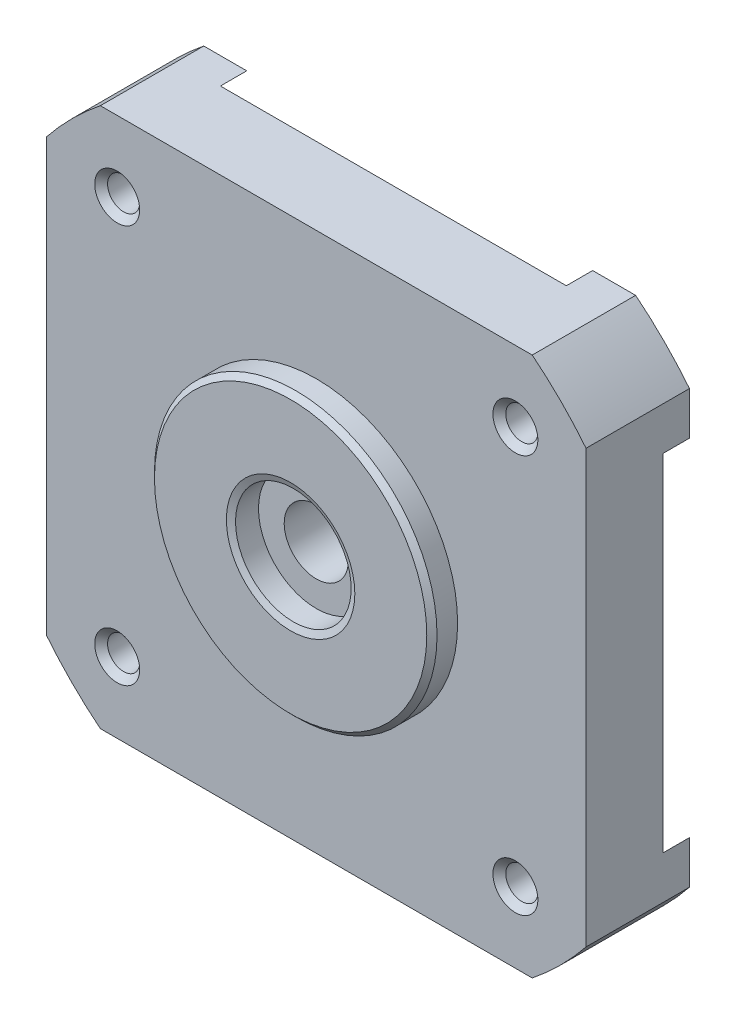
ISO-10303-21;
HEADER;
FILE_DESCRIPTION(('STEP AP214'),'2;1');
FILE_NAME('part.step','',(''),(''),'','','');
FILE_SCHEMA(('AUTOMOTIVE_DESIGN { 1 0 10303 214 1 1 1 1 }'));
ENDSEC;
DATA;
#1=APPLICATION_CONTEXT('core data for automotive mechanical design processes');
#2=APPLICATION_PROTOCOL_DEFINITION('international standard','automotive_design',2000,#1);
#3=PRODUCT_CONTEXT('',#1,'mechanical');
#4=PRODUCT('Part','Part','',(#3));
#5=PRODUCT_RELATED_PRODUCT_CATEGORY('part','',(#4));
#6=PRODUCT_DEFINITION_FORMATION('','',#4);
#7=PRODUCT_DEFINITION_CONTEXT('part definition',#1,'design');
#8=PRODUCT_DEFINITION('design','',#6,#7);
#9=PRODUCT_DEFINITION_SHAPE('','',#8);
#10=(LENGTH_UNIT() NAMED_UNIT(*) SI_UNIT(.MILLI.,.METRE.));
#11=(NAMED_UNIT(*) PLANE_ANGLE_UNIT() SI_UNIT($,.RADIAN.));
#12=(NAMED_UNIT(*) SI_UNIT($,.STERADIAN.) SOLID_ANGLE_UNIT());
#13=UNCERTAINTY_MEASURE_WITH_UNIT(LENGTH_MEASURE(1.E-05),#10,'distance_accuracy_value','');
#14=(GEOMETRIC_REPRESENTATION_CONTEXT(3) GLOBAL_UNCERTAINTY_ASSIGNED_CONTEXT((#13)) GLOBAL_UNIT_ASSIGNED_CONTEXT((#10,
#11,#12)) REPRESENTATION_CONTEXT('',''));
#15=CARTESIAN_POINT('',(0.,0.,0.));
#16=DIRECTION('',(0.,0.,1.));
#17=DIRECTION('',(1.,0.,0.));
#18=AXIS2_PLACEMENT_3D('',#15,#16,#17);
#19=CARTESIAN_POINT('',(-12.7931585590212,-13.4012649496147,22.25));
#20=DIRECTION('',(0.,0.,1.));
#21=DIRECTION('',(1.,0.,0.));
#22=AXIS2_PLACEMENT_3D('',#19,#20,#21);
#23=PLANE('',#22);
#24=CARTESIAN_POINT('',(0.,0.,22.250000000001));
#25=DIRECTION('',(0.,0.,1.));
#26=DIRECTION('',(1.,0.,0.));
#27=AXIS2_PLACEMENT_3D('',#24,#25,#26);
#28=CIRCLE('',#27,4.99999999999545);
#29=CARTESIAN_POINT('',(4.99999999999545,0.,22.250000000001));
#30=VERTEX_POINT('',#29);
#31=EDGE_CURVE('E217',#30,#30,#28,.F.);
#32=ORIENTED_EDGE('',*,*,#31,.T.);
#33=EDGE_LOOP('',(#32));
#34=FACE_BOUND('',#33,.T.);
#35=CARTESIAN_POINT('',(0.,0.,22.25));
#36=DIRECTION('',(0.,0.,-1.));
#37=DIRECTION('',(-1.,0.,0.));
#38=AXIS2_PLACEMENT_3D('',#35,#36,#37);
#39=CIRCLE('',#38,10.6000000000001);
#40=CARTESIAN_POINT('',(-10.6000000000001,0.,22.25));
#41=VERTEX_POINT('',#40);
#42=EDGE_CURVE('E20',#41,#41,#39,.T.);
#43=ORIENTED_EDGE('',*,*,#42,.F.);
#44=EDGE_LOOP('',(#43));
#45=FACE_BOUND('',#44,.T.);
#46=ADVANCED_FACE('F17',(#34,#45),#23,.T.);
#47=CARTESIAN_POINT('',(0.,0.,21.85));
#48=DIRECTION('',(0.,0.,-1.));
#49=DIRECTION('',(-1.,0.,0.));
#50=AXIS2_PLACEMENT_3D('',#47,#48,#49);
#51=CONICAL_SURFACE('',#50,11.0000000000001,0.785398163397461);
#52=CARTESIAN_POINT('',(0.,0.,21.85));
#53=DIRECTION('',(0.,0.,1.));
#54=DIRECTION('',(1.,0.,0.));
#55=AXIS2_PLACEMENT_3D('',#52,#53,#54);
#56=CIRCLE('',#55,11.0000000000001);
#57=CARTESIAN_POINT('',(11.0000000000001,0.,21.85));
#58=VERTEX_POINT('',#57);
#59=EDGE_CURVE('E213',#58,#58,#56,.F.);
#60=ORIENTED_EDGE('',*,*,#59,.F.);
#61=EDGE_LOOP('',(#60));
#62=FACE_BOUND('',#61,.T.);
#63=ORIENTED_EDGE('',*,*,#42,.T.);
#64=EDGE_LOOP('',(#63));
#65=FACE_BOUND('',#64,.T.);
#66=ADVANCED_FACE('F271',(#62,#65),#51,.T.);
#67=CARTESIAN_POINT('',(0.,0.,22.2499999999286));
#68=DIRECTION('',(0.,0.,1.));
#69=DIRECTION('',(1.,0.,0.));
#70=AXIS2_PLACEMENT_3D('',#67,#68,#69);
#71=CONICAL_SURFACE('',#70,4.99999999982492,1.16937059886515);
#72=ORIENTED_EDGE('',*,*,#31,.F.);
#73=EDGE_LOOP('',(#72));
#74=FACE_BOUND('',#73,.T.);
#75=CARTESIAN_POINT('',(0.,0.,22.0377625918952));
#76=DIRECTION('',(0.,0.,-1.));
#77=DIRECTION('',(-1.,0.,0.));
#78=AXIS2_PLACEMENT_3D('',#75,#76,#77);
#79=CIRCLE('',#78,4.5);
#80=CARTESIAN_POINT('',(-4.5,0.,22.0377625918952));
#81=VERTEX_POINT('',#80);
#82=EDGE_CURVE('E141',#81,#81,#79,.T.);
#83=ORIENTED_EDGE('',*,*,#82,.T.);
#84=EDGE_LOOP('',(#83));
#85=FACE_BOUND('',#84,.T.);
#86=ADVANCED_FACE('F278',(#74,#85),#71,.F.);
#87=CARTESIAN_POINT('',(0.,0.,20.75));
#88=DIRECTION('',(0.,0.,1.));
#89=DIRECTION('',(1.,0.,0.));
#90=AXIS2_PLACEMENT_3D('',#87,#88,#89);
#91=CYLINDRICAL_SURFACE('',#90,11.0000000000001);
#92=CARTESIAN_POINT('',(0.,0.,20.25));
#93=DIRECTION('',(0.,0.,1.));
#94=DIRECTION('',(1.,0.,0.));
#95=AXIS2_PLACEMENT_3D('',#92,#93,#94);
#96=CIRCLE('',#95,11.0000000000001);
#97=CARTESIAN_POINT('',(11.0000000000001,0.,20.25));
#98=VERTEX_POINT('',#97);
#99=EDGE_CURVE('E254',#98,#98,#96,.F.);
#100=ORIENTED_EDGE('',*,*,#99,.F.);
#101=EDGE_LOOP('',(#100));
#102=FACE_BOUND('',#101,.T.);
#103=ORIENTED_EDGE('',*,*,#59,.T.);
#104=EDGE_LOOP('',(#103));
#105=FACE_BOUND('',#104,.T.);
#106=ADVANCED_FACE('F392',(#102,#105),#91,.T.);
#107=CARTESIAN_POINT('',(0.,0.,22.0377625918952));
#108=DIRECTION('',(0.,0.,-1.));
#109=DIRECTION('',(-1.,0.,0.));
#110=AXIS2_PLACEMENT_3D('',#107,#108,#109);
#111=CYLINDRICAL_SURFACE('',#110,4.5);
#112=CARTESIAN_POINT('',(0.,0.,20.25));
#113=DIRECTION('',(0.,0.,-1.));
#114=DIRECTION('',(-1.,0.,0.));
#115=AXIS2_PLACEMENT_3D('',#112,#113,#114);
#116=CIRCLE('',#115,4.5);
#117=CARTESIAN_POINT('',(-4.5,0.,20.25));
#118=VERTEX_POINT('',#117);
#119=EDGE_CURVE('E247',#118,#118,#116,.F.);
#120=ORIENTED_EDGE('',*,*,#119,.F.);
#121=EDGE_LOOP('',(#120));
#122=FACE_BOUND('',#121,.T.);
#123=ORIENTED_EDGE('',*,*,#82,.F.);
#124=EDGE_LOOP('',(#123));
#125=FACE_BOUND('',#124,.T.);
#126=ADVANCED_FACE('F389',(#122,#125),#111,.F.);
#127=CARTESIAN_POINT('',(-13.4544660940676,-21.01,12.2));
#128=DIRECTION('',(0.,0.,-1.));
#129=DIRECTION('',(-1.,0.,0.));
#130=AXIS2_PLACEMENT_3D('',#127,#128,#129);
#131=PLANE('',#130);
#132=CARTESIAN_POINT('',(-2.47024622979097E-12,-2.47024622979097E-12,12.2000000000001));
#133=DIRECTION('',(0.,0.,1.));
#134=DIRECTION('',(1.,0.,0.));
#135=AXIS2_PLACEMENT_3D('',#132,#133,#134);
#136=CIRCLE('',#135,26.8999999999965);
#137=CARTESIAN_POINT('',(-21.,-16.8110082981361,12.2));
#138=VERTEX_POINT('',#137);
#139=CARTESIAN_POINT('',(-16.8110082981361,-21.,12.2));
#140=VERTEX_POINT('',#139);
#141=EDGE_CURVE('E129',#138,#140,#136,.T.);
#142=ORIENTED_EDGE('',*,*,#141,.F.);
#143=DIRECTION('',(0.,1.,0.));
#144=VECTOR('',#143,1.);
#145=CARTESIAN_POINT('',(-21.,-16.8210082981361,12.2));
#146=LINE('',#145,#144);
#147=CARTESIAN_POINT('',(-21.,-13.4644660940669,12.2));
#148=VERTEX_POINT('',#147);
#149=EDGE_CURVE('E134',#148,#138,#146,.F.);
#150=ORIENTED_EDGE('',*,*,#149,.F.);
#151=DIRECTION('',(-0.707106781186515,0.70710678118658,0.));
#152=VECTOR('',#151,1.);
#153=CARTESIAN_POINT('',(-13.4573950262557,-21.0070710678119,12.2));
#154=LINE('',#153,#152);
#155=CARTESIAN_POINT('',(-13.4644660940676,-21.,12.2));
#156=VERTEX_POINT('',#155);
#157=EDGE_CURVE('E156',#156,#148,#154,.T.);
#158=ORIENTED_EDGE('',*,*,#157,.F.);
#159=DIRECTION('',(1.,0.,0.));
#160=VECTOR('',#159,1.);
#161=CARTESIAN_POINT('',(-16.8210082981361,-21.,12.2));
#162=LINE('',#161,#160);
#163=EDGE_CURVE('E136',#140,#156,#162,.T.);
#164=ORIENTED_EDGE('',*,*,#163,.F.);
#165=EDGE_LOOP('',(#142,#150,#158,#164));
#166=FACE_BOUND('',#165,.T.);
#167=ADVANCED_FACE('F131',(#166),#131,.T.);
#168=CARTESIAN_POINT('',(-2.47024622979097E-12,-2.47024622979097E-12,12.2000000000001));
#169=DIRECTION('',(0.,0.,1.));
#170=DIRECTION('',(1.,0.,0.));
#171=AXIS2_PLACEMENT_3D('',#168,#169,#170);
#172=CYLINDRICAL_SURFACE('',#171,26.8999999999965);
#173=CARTESIAN_POINT('',(-2.50033645199544E-12,-2.50033645199544E-12,20.2500000000001));
#174=DIRECTION('',(0.,0.,1.));
#175=DIRECTION('',(1.,0.,0.));
#176=AXIS2_PLACEMENT_3D('',#173,#174,#175);
#177=CIRCLE('',#176,26.8999999999965);
#178=CARTESIAN_POINT('',(-21.,-16.8110082981361,20.25));
#179=VERTEX_POINT('',#178);
#180=CARTESIAN_POINT('',(-16.8110082981361,-21.,20.25));
#181=VERTEX_POINT('',#180);
#182=EDGE_CURVE('E146',#179,#181,#177,.T.);
#183=ORIENTED_EDGE('',*,*,#182,.F.);
#184=DIRECTION('',(0.,0.,1.));
#185=VECTOR('',#184,1.);
#186=CARTESIAN_POINT('',(-21.,-16.8110082981361,12.19));
#187=LINE('',#186,#185);
#188=EDGE_CURVE('E144',#138,#179,#187,.T.);
#189=ORIENTED_EDGE('',*,*,#188,.F.);
#190=ORIENTED_EDGE('',*,*,#141,.T.);
#191=DIRECTION('',(0.,0.,-1.));
#192=VECTOR('',#191,1.);
#193=CARTESIAN_POINT('',(-16.8110082981361,-21.,20.26));
#194=LINE('',#193,#192);
#195=EDGE_CURVE('E180',#181,#140,#194,.T.);
#196=ORIENTED_EDGE('',*,*,#195,.F.);
#197=EDGE_LOOP('',(#183,#189,#190,#196));
#198=FACE_BOUND('',#197,.T.);
#199=ADVANCED_FACE('F145',(#198),#172,.T.);
#200=CARTESIAN_POINT('',(-2.47024622979097E-12,2.47024622979097E-12,12.2000000000001));
#201=DIRECTION('',(0.,0.,1.));
#202=DIRECTION('',(1.,0.,0.));
#203=AXIS2_PLACEMENT_3D('',#200,#201,#202);
#204=CYLINDRICAL_SURFACE('',#203,26.8999999999965);
#205=CARTESIAN_POINT('',(-2.50033645199544E-12,2.50033645199544E-12,20.2500000000001));
#206=DIRECTION('',(0.,0.,1.));
#207=DIRECTION('',(1.,0.,0.));
#208=AXIS2_PLACEMENT_3D('',#205,#206,#207);
#209=CIRCLE('',#208,26.8999999999965);
#210=CARTESIAN_POINT('',(-16.8110082981361,21.,20.25));
#211=VERTEX_POINT('',#210);
#212=CARTESIAN_POINT('',(-21.,16.8110082981361,20.25));
#213=VERTEX_POINT('',#212);
#214=EDGE_CURVE('E258',#211,#213,#209,.T.);
#215=ORIENTED_EDGE('',*,*,#214,.F.);
#216=DIRECTION('',(0.,0.,1.));
#217=VECTOR('',#216,1.);
#218=CARTESIAN_POINT('',(-16.8110082981361,21.,12.19));
#219=LINE('',#218,#217);
#220=CARTESIAN_POINT('',(-16.8110082981361,21.,12.2));
#221=VERTEX_POINT('',#220);
#222=EDGE_CURVE('E663',#221,#211,#219,.T.);
#223=ORIENTED_EDGE('',*,*,#222,.F.);
#224=CARTESIAN_POINT('',(-2.47024622979097E-12,2.47024622979097E-12,12.2000000000001));
#225=DIRECTION('',(0.,0.,1.));
#226=DIRECTION('',(1.,0.,0.));
#227=AXIS2_PLACEMENT_3D('',#224,#225,#226);
#228=CIRCLE('',#227,26.8999999999965);
#229=CARTESIAN_POINT('',(-21.,16.8110082981361,12.2));
#230=VERTEX_POINT('',#229);
#231=EDGE_CURVE('E140',#230,#221,#228,.F.);
#232=ORIENTED_EDGE('',*,*,#231,.F.);
#233=DIRECTION('',(0.,0.,1.));
#234=VECTOR('',#233,1.);
#235=CARTESIAN_POINT('',(-21.,16.8110082981361,12.19));
#236=LINE('',#235,#234);
#237=EDGE_CURVE('E694',#213,#230,#236,.F.);
#238=ORIENTED_EDGE('',*,*,#237,.F.);
#239=EDGE_LOOP('',(#215,#223,#232,#238));
#240=FACE_BOUND('',#239,.T.);
#241=ADVANCED_FACE('F380',(#240),#204,.T.);
#242=CARTESIAN_POINT('',(-13.4544660940671,13.4544660940671,12.2));
#243=DIRECTION('',(0.,0.,-1.));
#244=DIRECTION('',(-1.,0.,0.));
#245=AXIS2_PLACEMENT_3D('',#242,#243,#244);
#246=PLANE('',#245);
#247=ORIENTED_EDGE('',*,*,#231,.T.);
#248=DIRECTION('',(1.,0.,0.));
#249=VECTOR('',#248,1.);
#250=CARTESIAN_POINT('',(-16.8210082981361,21.,12.2));
#251=LINE('',#250,#249);
#252=CARTESIAN_POINT('',(-13.4644660940672,21.,12.2));
#253=VERTEX_POINT('',#252);
#254=EDGE_CURVE('E643',#253,#221,#251,.F.);
#255=ORIENTED_EDGE('',*,*,#254,.F.);
#256=DIRECTION('',(0.707106781186543,0.707106781186552,0.));
#257=VECTOR('',#256,1.);
#258=CARTESIAN_POINT('',(-21.0070710678119,13.4573950262552,12.2));
#259=LINE('',#258,#257);
#260=CARTESIAN_POINT('',(-21.,13.4644660940671,12.2));
#261=VERTEX_POINT('',#260);
#262=EDGE_CURVE('E667',#261,#253,#259,.T.);
#263=ORIENTED_EDGE('',*,*,#262,.F.);
#264=DIRECTION('',(0.,1.,0.));
#265=VECTOR('',#264,1.);
#266=CARTESIAN_POINT('',(-21.,-16.8210082981361,12.2));
#267=LINE('',#266,#265);
#268=EDGE_CURVE('E690',#230,#261,#267,.F.);
#269=ORIENTED_EDGE('',*,*,#268,.F.);
#270=EDGE_LOOP('',(#247,#255,#263,#269));
#271=FACE_BOUND('',#270,.T.);
#272=ADVANCED_FACE('F376',(#271),#246,.T.);
#273=CARTESIAN_POINT('',(21.01,13.4544660940671,12.2));
#274=DIRECTION('',(0.,0.,-1.));
#275=DIRECTION('',(-1.,0.,0.));
#276=AXIS2_PLACEMENT_3D('',#273,#274,#275);
#277=PLANE('',#276);
#278=CARTESIAN_POINT('',(2.47024622979097E-12,2.47024622979097E-12,12.2000000000001));
#279=DIRECTION('',(0.,0.,1.));
#280=DIRECTION('',(1.,0.,0.));
#281=AXIS2_PLACEMENT_3D('',#278,#279,#280);
#282=CIRCLE('',#281,26.8999999999965);
#283=CARTESIAN_POINT('',(21.,16.8110082981361,12.2));
#284=VERTEX_POINT('',#283);
#285=CARTESIAN_POINT('',(16.8110082981361,21.,12.2));
#286=VERTEX_POINT('',#285);
#287=EDGE_CURVE('E262',#284,#286,#282,.T.);
#288=ORIENTED_EDGE('',*,*,#287,.F.);
#289=DIRECTION('',(0.,1.,0.));
#290=VECTOR('',#289,1.);
#291=CARTESIAN_POINT('',(21.,-16.8210082981361,12.2));
#292=LINE('',#291,#290);
#293=CARTESIAN_POINT('',(21.,13.4644660940671,12.2));
#294=VERTEX_POINT('',#293);
#295=EDGE_CURVE('E625',#294,#284,#292,.T.);
#296=ORIENTED_EDGE('',*,*,#295,.F.);
#297=DIRECTION('',(0.707106781186538,-0.707106781186557,0.));
#298=VECTOR('',#297,1.);
#299=CARTESIAN_POINT('',(21.0070710678119,13.4573950262553,12.2));
#300=LINE('',#299,#298);
#301=CARTESIAN_POINT('',(13.4644660940674,21.,12.2));
#302=VERTEX_POINT('',#301);
#303=EDGE_CURVE('E627',#302,#294,#300,.T.);
#304=ORIENTED_EDGE('',*,*,#303,.F.);
#305=DIRECTION('',(1.,0.,0.));
#306=VECTOR('',#305,1.);
#307=CARTESIAN_POINT('',(-16.8210082981361,21.,12.2));
#308=LINE('',#307,#306);
#309=EDGE_CURVE('E646',#286,#302,#308,.F.);
#310=ORIENTED_EDGE('',*,*,#309,.F.);
#311=EDGE_LOOP('',(#288,#296,#304,#310));
#312=FACE_BOUND('',#311,.T.);
#313=ADVANCED_FACE('F372',(#312),#277,.T.);
#314=CARTESIAN_POINT('',(2.47024622979097E-12,2.47024622979097E-12,12.2000000000001));
#315=DIRECTION('',(0.,0.,1.));
#316=DIRECTION('',(1.,0.,0.));
#317=AXIS2_PLACEMENT_3D('',#314,#315,#316);
#318=CYLINDRICAL_SURFACE('',#317,26.8999999999965);
#319=CARTESIAN_POINT('',(2.50033645199544E-12,2.50033645199544E-12,20.2500000000001));
#320=DIRECTION('',(0.,0.,1.));
#321=DIRECTION('',(1.,0.,0.));
#322=AXIS2_PLACEMENT_3D('',#319,#320,#321);
#323=CIRCLE('',#322,26.8999999999965);
#324=CARTESIAN_POINT('',(21.,16.8110082981361,20.25));
#325=VERTEX_POINT('',#324);
#326=CARTESIAN_POINT('',(16.8110082981361,21.,20.25));
#327=VERTEX_POINT('',#326);
#328=EDGE_CURVE('E260',#325,#327,#323,.T.);
#329=ORIENTED_EDGE('',*,*,#328,.F.);
#330=DIRECTION('',(0.,0.,-1.));
#331=VECTOR('',#330,1.);
#332=CARTESIAN_POINT('',(21.,16.8110082981361,20.26));
#333=LINE('',#332,#331);
#334=EDGE_CURVE('E621',#284,#325,#333,.F.);
#335=ORIENTED_EDGE('',*,*,#334,.F.);
#336=ORIENTED_EDGE('',*,*,#287,.T.);
#337=DIRECTION('',(0.,0.,1.));
#338=VECTOR('',#337,1.);
#339=CARTESIAN_POINT('',(16.8110082981361,21.,12.19));
#340=LINE('',#339,#338);
#341=EDGE_CURVE('E649',#327,#286,#340,.F.);
#342=ORIENTED_EDGE('',*,*,#341,.F.);
#343=EDGE_LOOP('',(#329,#335,#336,#342));
#344=FACE_BOUND('',#343,.T.);
#345=ADVANCED_FACE('F368',(#344),#318,.T.);
#346=CARTESIAN_POINT('',(-21.01,-21.01,20.25));
#347=DIRECTION('',(0.,0.,1.));
#348=DIRECTION('',(1.,0.,0.));
#349=AXIS2_PLACEMENT_3D('',#346,#347,#348);
#350=PLANE('',#349);
#351=CARTESIAN_POINT('',(15.5,15.5000000000009,20.2499999999445));
#352=DIRECTION('',(0.,0.,1.));
#353=DIRECTION('',(1.,0.,0.));
#354=AXIS2_PLACEMENT_3D('',#351,#352,#353);
#355=CIRCLE('',#354,1.74999999995862);
#356=CARTESIAN_POINT('',(17.2499999999586,15.5000000000009,20.2499999999445));
#357=VERTEX_POINT('',#356);
#358=EDGE_CURVE('E238',#357,#357,#355,.F.);
#359=ORIENTED_EDGE('',*,*,#358,.T.);
#360=EDGE_LOOP('',(#359));
#361=FACE_BOUND('',#360,.T.);
#362=CARTESIAN_POINT('',(-15.4999999999992,-15.5,20.2499999999512));
#363=DIRECTION('',(0.,0.,1.));
#364=DIRECTION('',(1.,0.,0.));
#365=AXIS2_PLACEMENT_3D('',#362,#363,#364);
#366=CIRCLE('',#365,1.75000000001546);
#367=CARTESIAN_POINT('',(-13.7499999999837,-15.5,20.2499999999512));
#368=VERTEX_POINT('',#367);
#369=EDGE_CURVE('E244',#368,#368,#366,.F.);
#370=ORIENTED_EDGE('',*,*,#369,.T.);
#371=EDGE_LOOP('',(#370));
#372=FACE_BOUND('',#371,.T.);
#373=CARTESIAN_POINT('',(-15.5,15.5,20.2499999999759));
#374=DIRECTION('',(0.,0.,1.));
#375=DIRECTION('',(1.,0.,0.));
#376=AXIS2_PLACEMENT_3D('',#373,#374,#375);
#377=CIRCLE('',#376,1.74999999998408);
#378=CARTESIAN_POINT('',(-13.7500000000159,15.5,20.2499999999759));
#379=VERTEX_POINT('',#378);
#380=EDGE_CURVE('E241',#379,#379,#377,.F.);
#381=ORIENTED_EDGE('',*,*,#380,.T.);
#382=EDGE_LOOP('',(#381));
#383=FACE_BOUND('',#382,.T.);
#384=CARTESIAN_POINT('',(15.5000000000009,-15.4999999999992,20.2499999999759));
#385=DIRECTION('',(0.,0.,1.));
#386=DIRECTION('',(1.,0.,0.));
#387=AXIS2_PLACEMENT_3D('',#384,#385,#386);
#388=CIRCLE('',#387,1.7499999999891);
#389=CARTESIAN_POINT('',(17.24999999999,-15.4999999999992,20.2499999999759));
#390=VERTEX_POINT('',#389);
#391=EDGE_CURVE('E235',#390,#390,#388,.F.);
#392=ORIENTED_EDGE('',*,*,#391,.T.);
#393=EDGE_LOOP('',(#392));
#394=FACE_BOUND('',#393,.T.);
#395=ORIENTED_EDGE('',*,*,#99,.T.);
#396=EDGE_LOOP('',(#395));
#397=FACE_BOUND('',#396,.T.);
#398=ORIENTED_EDGE('',*,*,#182,.T.);
#399=DIRECTION('',(1.,0.,0.));
#400=VECTOR('',#399,1.);
#401=CARTESIAN_POINT('',(-16.8210082981361,-21.,20.25));
#402=LINE('',#401,#400);
#403=CARTESIAN_POINT('',(16.8110082981361,-21.,20.25));
#404=VERTEX_POINT('',#403);
#405=EDGE_CURVE('E189',#404,#181,#402,.F.);
#406=ORIENTED_EDGE('',*,*,#405,.F.);
#407=CARTESIAN_POINT('',(2.50033645199544E-12,-2.50033645199544E-12,20.2500000000001));
#408=DIRECTION('',(0.,0.,1.));
#409=DIRECTION('',(1.,0.,0.));
#410=AXIS2_PLACEMENT_3D('',#407,#408,#409);
#411=CIRCLE('',#410,26.8999999999965);
#412=CARTESIAN_POINT('',(21.,-16.8110082981361,20.25));
#413=VERTEX_POINT('',#412);
#414=EDGE_CURVE('E252',#413,#404,#411,.F.);
#415=ORIENTED_EDGE('',*,*,#414,.F.);
#416=DIRECTION('',(0.,1.,0.));
#417=VECTOR('',#416,1.);
#418=CARTESIAN_POINT('',(21.,-16.8210082981361,20.25));
#419=LINE('',#418,#417);
#420=EDGE_CURVE('E617',#325,#413,#419,.F.);
#421=ORIENTED_EDGE('',*,*,#420,.F.);
#422=ORIENTED_EDGE('',*,*,#328,.T.);
#423=DIRECTION('',(1.,0.,0.));
#424=VECTOR('',#423,1.);
#425=CARTESIAN_POINT('',(-16.8210082981361,21.,20.25));
#426=LINE('',#425,#424);
#427=EDGE_CURVE('E666',#211,#327,#426,.T.);
#428=ORIENTED_EDGE('',*,*,#427,.F.);
#429=ORIENTED_EDGE('',*,*,#214,.T.);
#430=DIRECTION('',(0.,1.,0.));
#431=VECTOR('',#430,1.);
#432=CARTESIAN_POINT('',(-21.,-16.8210082981361,20.25));
#433=LINE('',#432,#431);
#434=EDGE_CURVE('E150',#179,#213,#433,.T.);
#435=ORIENTED_EDGE('',*,*,#434,.F.);
#436=EDGE_LOOP('',(#398,#406,#415,#421,#422,#428,#429,#435));
#437=FACE_BOUND('',#436,.T.);
#438=ADVANCED_FACE('F364',(#361,#372,#383,#394,#397,#437),#350,.T.);
#439=CARTESIAN_POINT('',(2.47024622979097E-12,-2.47024622979097E-12,12.2000000000001));
#440=DIRECTION('',(0.,0.,1.));
#441=DIRECTION('',(1.,0.,0.));
#442=AXIS2_PLACEMENT_3D('',#439,#440,#441);
#443=CYLINDRICAL_SURFACE('',#442,26.8999999999965);
#444=ORIENTED_EDGE('',*,*,#414,.T.);
#445=DIRECTION('',(0.,0.,-1.));
#446=VECTOR('',#445,1.);
#447=CARTESIAN_POINT('',(16.8110082981361,-21.,20.26));
#448=LINE('',#447,#446);
#449=CARTESIAN_POINT('',(16.8110082981361,-21.,12.2));
#450=VERTEX_POINT('',#449);
#451=EDGE_CURVE('E192',#450,#404,#448,.F.);
#452=ORIENTED_EDGE('',*,*,#451,.F.);
#453=CARTESIAN_POINT('',(2.47024622979097E-12,-2.47024622979097E-12,12.2000000000001));
#454=DIRECTION('',(0.,0.,1.));
#455=DIRECTION('',(1.,0.,0.));
#456=AXIS2_PLACEMENT_3D('',#453,#454,#455);
#457=CIRCLE('',#456,26.8999999999965);
#458=CARTESIAN_POINT('',(21.,-16.8110082981361,12.2));
#459=VERTEX_POINT('',#458);
#460=EDGE_CURVE('E250',#459,#450,#457,.F.);
#461=ORIENTED_EDGE('',*,*,#460,.F.);
#462=DIRECTION('',(0.,0.,-1.));
#463=VECTOR('',#462,1.);
#464=CARTESIAN_POINT('',(21.,-16.8110082981361,20.26));
#465=LINE('',#464,#463);
#466=EDGE_CURVE('E614',#413,#459,#465,.T.);
#467=ORIENTED_EDGE('',*,*,#466,.F.);
#468=EDGE_LOOP('',(#444,#452,#461,#467));
#469=FACE_BOUND('',#468,.T.);
#470=ADVANCED_FACE('F360',(#469),#443,.T.);
#471=CARTESIAN_POINT('',(21.01,-21.01,12.2));
#472=DIRECTION('',(0.,0.,-1.));
#473=DIRECTION('',(-1.,0.,0.));
#474=AXIS2_PLACEMENT_3D('',#471,#472,#473);
#475=PLANE('',#474);
#476=ORIENTED_EDGE('',*,*,#460,.T.);
#477=DIRECTION('',(1.,0.,0.));
#478=VECTOR('',#477,1.);
#479=CARTESIAN_POINT('',(-16.8210082981361,-21.,12.2));
#480=LINE('',#479,#478);
#481=CARTESIAN_POINT('',(13.4644660940674,-21.,12.2));
#482=VERTEX_POINT('',#481);
#483=EDGE_CURVE('E195',#482,#450,#480,.T.);
#484=ORIENTED_EDGE('',*,*,#483,.F.);
#485=DIRECTION('',(-0.707106781186543,-0.707106781186552,0.));
#486=VECTOR('',#485,1.);
#487=CARTESIAN_POINT('',(13.4573950262555,-21.0070710678119,12.2));
#488=LINE('',#487,#486);
#489=CARTESIAN_POINT('',(21.,-13.4644660940672,12.2));
#490=VERTEX_POINT('',#489);
#491=EDGE_CURVE('E203',#490,#482,#488,.T.);
#492=ORIENTED_EDGE('',*,*,#491,.F.);
#493=DIRECTION('',(0.,1.,0.));
#494=VECTOR('',#493,1.);
#495=CARTESIAN_POINT('',(21.,-16.8210082981361,12.2));
#496=LINE('',#495,#494);
#497=EDGE_CURVE('E714',#459,#490,#496,.T.);
#498=ORIENTED_EDGE('',*,*,#497,.F.);
#499=EDGE_LOOP('',(#476,#484,#492,#498));
#500=FACE_BOUND('',#499,.T.);
#501=ADVANCED_FACE('F356',(#500),#475,.T.);
#502=CARTESIAN_POINT('',(-4.51,-4.51,20.25));
#503=DIRECTION('',(0.,0.,1.));
#504=DIRECTION('',(1.,0.,0.));
#505=AXIS2_PLACEMENT_3D('',#502,#503,#504);
#506=PLANE('',#505);
#507=CARTESIAN_POINT('',(0.,0.,20.25));
#508=DIRECTION('',(0.,0.,-1.));
#509=DIRECTION('',(0.,1.,0.));
#510=AXIS2_PLACEMENT_3D('',#507,#508,#509);
#511=CIRCLE('',#510,2.5);
#512=CARTESIAN_POINT('',(0.,2.50000000000004,20.25));
#513=VERTEX_POINT('',#512);
#514=EDGE_CURVE('E231',#513,#513,#511,.T.);
#515=ORIENTED_EDGE('',*,*,#514,.T.);
#516=EDGE_LOOP('',(#515));
#517=FACE_BOUND('',#516,.T.);
#518=ORIENTED_EDGE('',*,*,#119,.T.);
#519=EDGE_LOOP('',(#518));
#520=FACE_BOUND('',#519,.T.);
#521=ADVANCED_FACE('F352',(#517,#520),#506,.T.);
#522=CARTESIAN_POINT('',(-15.4999999999992,-15.5,20.2500000000327));
#523=DIRECTION('',(0.,0.,1.));
#524=DIRECTION('',(1.,0.,0.));
#525=AXIS2_PLACEMENT_3D('',#522,#523,#524);
#526=CONICAL_SURFACE('',#525,1.75000000009697,0.785398163454292);
#527=ORIENTED_EDGE('',*,*,#369,.F.);
#528=EDGE_LOOP('',(#527));
#529=FACE_BOUND('',#528,.T.);
#530=CARTESIAN_POINT('',(-15.4999999999992,-15.5,19.75));
#531=DIRECTION('',(0.,0.,1.));
#532=DIRECTION('',(1.,0.,0.));
#533=AXIS2_PLACEMENT_3D('',#530,#531,#532);
#534=CIRCLE('',#533,1.24999999999995);
#535=CARTESIAN_POINT('',(-14.2499999999992,-15.5,19.75));
#536=VERTEX_POINT('',#535);
#537=EDGE_CURVE('E234',#536,#536,#534,.F.);
#538=ORIENTED_EDGE('',*,*,#537,.T.);
#539=EDGE_LOOP('',(#538));
#540=FACE_BOUND('',#539,.T.);
#541=ADVANCED_FACE('F348',(#529,#540),#526,.F.);
#542=CARTESIAN_POINT('',(-15.5,15.5,20.2499999999759));
#543=DIRECTION('',(0.,0.,1.));
#544=DIRECTION('',(1.,0.,0.));
#545=AXIS2_PLACEMENT_3D('',#542,#543,#544);
#546=CONICAL_SURFACE('',#545,1.74999999998408,0.785398163340605);
#547=ORIENTED_EDGE('',*,*,#380,.F.);
#548=EDGE_LOOP('',(#547));
#549=FACE_BOUND('',#548,.T.);
#550=CARTESIAN_POINT('',(-15.5,15.5,19.75));
#551=DIRECTION('',(0.,0.,1.));
#552=DIRECTION('',(1.,0.,0.));
#553=AXIS2_PLACEMENT_3D('',#550,#551,#552);
#554=CIRCLE('',#553,1.25);
#555=CARTESIAN_POINT('',(-14.25,15.5,19.75));
#556=VERTEX_POINT('',#555);
#557=EDGE_CURVE('E727',#556,#556,#554,.F.);
#558=ORIENTED_EDGE('',*,*,#557,.T.);
#559=EDGE_LOOP('',(#558));
#560=FACE_BOUND('',#559,.T.);
#561=ADVANCED_FACE('F344',(#549,#560),#546,.F.);
#562=CARTESIAN_POINT('',(15.5,15.5000000000009,20.2499999998622));
#563=DIRECTION('',(0.,0.,1.));
#564=DIRECTION('',(1.,0.,0.));
#565=AXIS2_PLACEMENT_3D('',#562,#563,#564);
#566=CONICAL_SURFACE('',#565,1.74999999987631,0.785398163397448);
#567=ORIENTED_EDGE('',*,*,#358,.F.);
#568=EDGE_LOOP('',(#567));
#569=FACE_BOUND('',#568,.T.);
#570=CARTESIAN_POINT('',(15.5,15.5000000000009,19.75));
#571=DIRECTION('',(0.,0.,1.));
#572=DIRECTION('',(1.,0.,0.));
#573=AXIS2_PLACEMENT_3D('',#570,#571,#572);
#574=CIRCLE('',#573,1.25);
#575=CARTESIAN_POINT('',(16.75,15.5000000000009,19.75));
#576=VERTEX_POINT('',#575);
#577=EDGE_CURVE('E730',#576,#576,#574,.F.);
#578=ORIENTED_EDGE('',*,*,#577,.T.);
#579=EDGE_LOOP('',(#578));
#580=FACE_BOUND('',#579,.T.);
#581=ADVANCED_FACE('F340',(#569,#580),#566,.F.);
#582=CARTESIAN_POINT('',(15.5000000000009,-15.4999999999992,20.2499999999759));
#583=DIRECTION('',(0.,0.,1.));
#584=DIRECTION('',(1.,0.,0.));
#585=AXIS2_PLACEMENT_3D('',#582,#583,#584);
#586=CONICAL_SURFACE('',#585,1.7499999999891,0.785398163340605);
#587=ORIENTED_EDGE('',*,*,#391,.F.);
#588=EDGE_LOOP('',(#587));
#589=FACE_BOUND('',#588,.T.);
#590=CARTESIAN_POINT('',(15.5000000000009,-15.4999999999992,19.75));
#591=DIRECTION('',(0.,0.,1.));
#592=DIRECTION('',(1.,0.,0.));
#593=AXIS2_PLACEMENT_3D('',#590,#591,#592);
#594=CIRCLE('',#593,1.24999999999995);
#595=CARTESIAN_POINT('',(16.7500000000009,-15.4999999999992,19.75));
#596=VERTEX_POINT('',#595);
#597=EDGE_CURVE('E208',#596,#596,#594,.F.);
#598=ORIENTED_EDGE('',*,*,#597,.T.);
#599=EDGE_LOOP('',(#598));
#600=FACE_BOUND('',#599,.T.);
#601=ADVANCED_FACE('F336',(#589,#600),#586,.F.);
#602=CARTESIAN_POINT('',(13.4573950262555,-21.0070710678119,12.19));
#603=DIRECTION('',(-0.707106781186552,0.707106781186543,0.));
#604=DIRECTION('',(-0.707106781186543,-0.707106781186552,0.));
#605=AXIS2_PLACEMENT_3D('',#602,#603,#604);
#606=PLANE('',#605);
#607=DIRECTION('',(0.,0.,-1.));
#608=VECTOR('',#607,1.);
#609=CARTESIAN_POINT('',(21.,-13.4644660940672,20.26));
#610=LINE('',#609,#608);
#611=CARTESIAN_POINT('',(21.,-13.4644660940672,14.25));
#612=VERTEX_POINT('',#611);
#613=EDGE_CURVE('E638',#490,#612,#610,.F.);
#614=ORIENTED_EDGE('',*,*,#613,.F.);
#615=ORIENTED_EDGE('',*,*,#491,.T.);
#616=DIRECTION('',(0.,0.,-1.));
#617=VECTOR('',#616,1.);
#618=CARTESIAN_POINT('',(13.4644660940674,-21.,20.26));
#619=LINE('',#618,#617);
#620=CARTESIAN_POINT('',(13.4644660940674,-21.,14.25));
#621=VERTEX_POINT('',#620);
#622=EDGE_CURVE('E198',#621,#482,#619,.T.);
#623=ORIENTED_EDGE('',*,*,#622,.F.);
#624=DIRECTION('',(-0.707106781186538,-0.707106781186557,0.));
#625=VECTOR('',#624,1.);
#626=CARTESIAN_POINT('',(21.,-13.4644660940672,14.25));
#627=LINE('',#626,#625);
#628=EDGE_CURVE('E185',#612,#621,#627,.T.);
#629=ORIENTED_EDGE('',*,*,#628,.F.);
#630=EDGE_LOOP('',(#614,#615,#623,#629));
#631=FACE_BOUND('',#630,.T.);
#632=ADVANCED_FACE('F332',(#631),#606,.T.);
#633=CARTESIAN_POINT('',(-16.8210082981361,-21.,20.26));
#634=DIRECTION('',(0.,-1.,0.));
#635=DIRECTION('',(0.,0.,-1.));
#636=AXIS2_PLACEMENT_3D('',#633,#634,#635);
#637=PLANE('',#636);
#638=DIRECTION('',(0.,0.,1.));
#639=VECTOR('',#638,1.);
#640=CARTESIAN_POINT('',(-13.4644660940676,-21.,14.26));
#641=LINE('',#640,#639);
#642=CARTESIAN_POINT('',(-13.4644660940676,-21.,14.25));
#643=VERTEX_POINT('',#642);
#644=EDGE_CURVE('E165',#643,#156,#641,.F.);
#645=ORIENTED_EDGE('',*,*,#644,.F.);
#646=DIRECTION('',(-1.,0.,0.));
#647=VECTOR('',#646,1.);
#648=CARTESIAN_POINT('',(21.01,-21.,14.25));
#649=LINE('',#648,#647);
#650=EDGE_CURVE('E172',#621,#643,#649,.T.);
#651=ORIENTED_EDGE('',*,*,#650,.F.);
#652=ORIENTED_EDGE('',*,*,#622,.T.);
#653=ORIENTED_EDGE('',*,*,#483,.T.);
#654=ORIENTED_EDGE('',*,*,#451,.T.);
#655=ORIENTED_EDGE('',*,*,#405,.T.);
#656=ORIENTED_EDGE('',*,*,#195,.T.);
#657=ORIENTED_EDGE('',*,*,#163,.T.);
#658=EDGE_LOOP('',(#645,#651,#652,#653,#654,#655,#656,#657));
#659=FACE_BOUND('',#658,.T.);
#660=ADVANCED_FACE('F328',(#659),#637,.T.);
#661=CARTESIAN_POINT('',(-13.4573950262557,-21.0070710678119,14.26));
#662=DIRECTION('',(0.70710678118658,0.707106781186515,0.));
#663=DIRECTION('',(-0.707106781186515,0.70710678118658,0.));
#664=AXIS2_PLACEMENT_3D('',#661,#662,#663);
#665=PLANE('',#664);
#666=ORIENTED_EDGE('',*,*,#644,.T.);
#667=ORIENTED_EDGE('',*,*,#157,.T.);
#668=DIRECTION('',(0.,0.,1.));
#669=VECTOR('',#668,1.);
#670=CARTESIAN_POINT('',(-21.,-13.4644660940669,12.19));
#671=LINE('',#670,#669);
#672=CARTESIAN_POINT('',(-21.,-13.4644660940669,14.25));
#673=VERTEX_POINT('',#672);
#674=EDGE_CURVE('E154',#673,#148,#671,.F.);
#675=ORIENTED_EDGE('',*,*,#674,.F.);
#676=DIRECTION('',(-0.707106781186515,0.70710678118658,0.));
#677=VECTOR('',#676,1.);
#678=CARTESIAN_POINT('',(-13.4644660940676,-21.,14.25));
#679=LINE('',#678,#677);
#680=EDGE_CURVE('E168',#643,#673,#679,.T.);
#681=ORIENTED_EDGE('',*,*,#680,.F.);
#682=EDGE_LOOP('',(#666,#667,#675,#681));
#683=FACE_BOUND('',#682,.T.);
#684=ADVANCED_FACE('F325',(#683),#665,.T.);
#685=CARTESIAN_POINT('',(-21.,-16.8210082981361,12.19));
#686=DIRECTION('',(-1.,0.,0.));
#687=DIRECTION('',(0.,0.,1.));
#688=AXIS2_PLACEMENT_3D('',#685,#686,#687);
#689=PLANE('',#688);
#690=DIRECTION('',(0.,0.,1.));
#691=VECTOR('',#690,1.);
#692=CARTESIAN_POINT('',(-21.,13.4644660940671,14.26));
#693=LINE('',#692,#691);
#694=CARTESIAN_POINT('',(-21.,13.4644660940671,14.25));
#695=VERTEX_POINT('',#694);
#696=EDGE_CURVE('E677',#695,#261,#693,.F.);
#697=ORIENTED_EDGE('',*,*,#696,.F.);
#698=DIRECTION('',(0.,1.,0.));
#699=VECTOR('',#698,1.);
#700=CARTESIAN_POINT('',(-21.,-21.01,14.25));
#701=LINE('',#700,#699);
#702=EDGE_CURVE('E171',#673,#695,#701,.T.);
#703=ORIENTED_EDGE('',*,*,#702,.F.);
#704=ORIENTED_EDGE('',*,*,#674,.T.);
#705=ORIENTED_EDGE('',*,*,#149,.T.);
#706=ORIENTED_EDGE('',*,*,#188,.T.);
#707=ORIENTED_EDGE('',*,*,#434,.T.);
#708=ORIENTED_EDGE('',*,*,#237,.T.);
#709=ORIENTED_EDGE('',*,*,#268,.T.);
#710=EDGE_LOOP('',(#697,#703,#704,#705,#706,#707,#708,#709));
#711=FACE_BOUND('',#710,.T.);
#712=ADVANCED_FACE('F152',(#711),#689,.T.);
#713=CARTESIAN_POINT('',(-21.0070710678119,13.4573950262552,14.26));
#714=DIRECTION('',(0.707106781186552,-0.707106781186543,0.));
#715=DIRECTION('',(0.707106781186543,0.707106781186552,0.));
#716=AXIS2_PLACEMENT_3D('',#713,#714,#715);
#717=PLANE('',#716);
#718=ORIENTED_EDGE('',*,*,#696,.T.);
#719=ORIENTED_EDGE('',*,*,#262,.T.);
#720=DIRECTION('',(0.,0.,1.));
#721=VECTOR('',#720,1.);
#722=CARTESIAN_POINT('',(-13.4644660940672,21.,12.19));
#723=LINE('',#722,#721);
#724=CARTESIAN_POINT('',(-13.4644660940672,21.,14.25));
#725=VERTEX_POINT('',#724);
#726=EDGE_CURVE('E648',#725,#253,#723,.F.);
#727=ORIENTED_EDGE('',*,*,#726,.F.);
#728=DIRECTION('',(0.707106781186543,0.707106781186552,0.));
#729=VECTOR('',#728,1.);
#730=CARTESIAN_POINT('',(-21.,13.4644660940671,14.25));
#731=LINE('',#730,#729);
#732=EDGE_CURVE('E660',#695,#725,#731,.T.);
#733=ORIENTED_EDGE('',*,*,#732,.F.);
#734=EDGE_LOOP('',(#718,#719,#727,#733));
#735=FACE_BOUND('',#734,.T.);
#736=ADVANCED_FACE('F318',(#735),#717,.T.);
#737=CARTESIAN_POINT('',(-16.8210082981361,21.,12.19));
#738=DIRECTION('',(0.,1.,0.));
#739=DIRECTION('',(0.,0.,1.));
#740=AXIS2_PLACEMENT_3D('',#737,#738,#739);
#741=PLANE('',#740);
#742=ORIENTED_EDGE('',*,*,#726,.T.);
#743=ORIENTED_EDGE('',*,*,#254,.T.);
#744=ORIENTED_EDGE('',*,*,#222,.T.);
#745=ORIENTED_EDGE('',*,*,#427,.T.);
#746=ORIENTED_EDGE('',*,*,#341,.T.);
#747=ORIENTED_EDGE('',*,*,#309,.T.);
#748=DIRECTION('',(0.,0.,1.));
#749=VECTOR('',#748,1.);
#750=CARTESIAN_POINT('',(13.4644660940674,21.,12.19));
#751=LINE('',#750,#749);
#752=CARTESIAN_POINT('',(13.4644660940674,21.,14.25));
#753=VERTEX_POINT('',#752);
#754=EDGE_CURVE('E634',#753,#302,#751,.F.);
#755=ORIENTED_EDGE('',*,*,#754,.F.);
#756=DIRECTION('',(-1.,0.,0.));
#757=VECTOR('',#756,1.);
#758=CARTESIAN_POINT('',(21.01,21.,14.25));
#759=LINE('',#758,#757);
#760=EDGE_CURVE('E655',#725,#753,#759,.F.);
#761=ORIENTED_EDGE('',*,*,#760,.F.);
#762=EDGE_LOOP('',(#742,#743,#744,#745,#746,#747,#755,#761));
#763=FACE_BOUND('',#762,.T.);
#764=ADVANCED_FACE('F315',(#763),#741,.T.);
#765=CARTESIAN_POINT('',(21.0070710678119,13.4573950262553,12.19));
#766=DIRECTION('',(-0.707106781186557,-0.707106781186538,0.));
#767=DIRECTION('',(0.707106781186538,-0.707106781186557,0.));
#768=AXIS2_PLACEMENT_3D('',#765,#766,#767);
#769=PLANE('',#768);
#770=ORIENTED_EDGE('',*,*,#754,.T.);
#771=ORIENTED_EDGE('',*,*,#303,.T.);
#772=DIRECTION('',(0.,0.,-1.));
#773=VECTOR('',#772,1.);
#774=CARTESIAN_POINT('',(21.,13.4644660940671,20.26));
#775=LINE('',#774,#773);
#776=CARTESIAN_POINT('',(21.,13.4644660940671,14.25));
#777=VERTEX_POINT('',#776);
#778=EDGE_CURVE('E35',#777,#294,#775,.T.);
#779=ORIENTED_EDGE('',*,*,#778,.F.);
#780=DIRECTION('',(0.707106781186533,-0.707106781186562,0.));
#781=VECTOR('',#780,1.);
#782=CARTESIAN_POINT('',(13.4644660940674,21.,14.25));
#783=LINE('',#782,#781);
#784=EDGE_CURVE('E652',#753,#777,#783,.T.);
#785=ORIENTED_EDGE('',*,*,#784,.F.);
#786=EDGE_LOOP('',(#770,#771,#779,#785));
#787=FACE_BOUND('',#786,.T.);
#788=ADVANCED_FACE('F311',(#787),#769,.T.);
#789=CARTESIAN_POINT('',(21.,-16.8210082981361,20.26));
#790=DIRECTION('',(1.,0.,0.));
#791=DIRECTION('',(0.,0.,-1.));
#792=AXIS2_PLACEMENT_3D('',#789,#790,#791);
#793=PLANE('',#792);
#794=DIRECTION('',(0.,1.,0.));
#795=VECTOR('',#794,1.);
#796=CARTESIAN_POINT('',(21.,-21.01,14.25));
#797=LINE('',#796,#795);
#798=EDGE_CURVE('E230',#777,#612,#797,.F.);
#799=ORIENTED_EDGE('',*,*,#798,.F.);
#800=ORIENTED_EDGE('',*,*,#778,.T.);
#801=ORIENTED_EDGE('',*,*,#295,.T.);
#802=ORIENTED_EDGE('',*,*,#334,.T.);
#803=ORIENTED_EDGE('',*,*,#420,.T.);
#804=ORIENTED_EDGE('',*,*,#466,.T.);
#805=ORIENTED_EDGE('',*,*,#497,.T.);
#806=ORIENTED_EDGE('',*,*,#613,.T.);
#807=EDGE_LOOP('',(#799,#800,#801,#802,#803,#804,#805,#806));
#808=FACE_BOUND('',#807,.T.);
#809=ADVANCED_FACE('F307',(#808),#793,.T.);
#810=CARTESIAN_POINT('',(0.,0.,40.0500033378601));
#811=DIRECTION('',(0.,0.,-1.));
#812=DIRECTION('',(0.,1.,0.));
#813=AXIS2_PLACEMENT_3D('',#810,#811,#812);
#814=CYLINDRICAL_SURFACE('',#813,2.5);
#815=CARTESIAN_POINT('',(0.,0.,14.25));
#816=DIRECTION('',(0.,0.,-1.));
#817=DIRECTION('',(0.,1.,0.));
#818=AXIS2_PLACEMENT_3D('',#815,#816,#817);
#819=CIRCLE('',#818,2.5);
#820=CARTESIAN_POINT('',(0.,2.50000000000004,14.25));
#821=VERTEX_POINT('',#820);
#822=EDGE_CURVE('E227',#821,#821,#819,.F.);
#823=ORIENTED_EDGE('',*,*,#822,.F.);
#824=EDGE_LOOP('',(#823));
#825=FACE_BOUND('',#824,.T.);
#826=ORIENTED_EDGE('',*,*,#514,.F.);
#827=EDGE_LOOP('',(#826));
#828=FACE_BOUND('',#827,.T.);
#829=ADVANCED_FACE('F303',(#825,#828),#814,.F.);
#830=CARTESIAN_POINT('',(-15.4999999999992,-15.5,14.25));
#831=DIRECTION('',(0.,0.,1.));
#832=DIRECTION('',(1.,0.,0.));
#833=AXIS2_PLACEMENT_3D('',#830,#831,#832);
#834=CYLINDRICAL_SURFACE('',#833,1.24999999999995);
#835=ORIENTED_EDGE('',*,*,#537,.F.);
#836=EDGE_LOOP('',(#835));
#837=FACE_BOUND('',#836,.T.);
#838=CARTESIAN_POINT('',(-15.4999999999992,-15.5,14.25));
#839=DIRECTION('',(0.,0.,1.));
#840=DIRECTION('',(1.,0.,0.));
#841=AXIS2_PLACEMENT_3D('',#838,#839,#840);
#842=CIRCLE('',#841,1.24999999999995);
#843=CARTESIAN_POINT('',(-14.2499999999992,-15.5,14.25));
#844=VERTEX_POINT('',#843);
#845=EDGE_CURVE('E224',#844,#844,#842,.T.);
#846=ORIENTED_EDGE('',*,*,#845,.F.);
#847=EDGE_LOOP('',(#846));
#848=FACE_BOUND('',#847,.T.);
#849=ADVANCED_FACE('F299',(#837,#848),#834,.F.);
#850=CARTESIAN_POINT('',(-15.5,15.5,14.25));
#851=DIRECTION('',(0.,0.,1.));
#852=DIRECTION('',(1.,0.,0.));
#853=AXIS2_PLACEMENT_3D('',#850,#851,#852);
#854=CYLINDRICAL_SURFACE('',#853,1.25);
#855=ORIENTED_EDGE('',*,*,#557,.F.);
#856=EDGE_LOOP('',(#855));
#857=FACE_BOUND('',#856,.T.);
#858=CARTESIAN_POINT('',(-15.5,15.5,14.25));
#859=DIRECTION('',(0.,0.,1.));
#860=DIRECTION('',(1.,0.,0.));
#861=AXIS2_PLACEMENT_3D('',#858,#859,#860);
#862=CIRCLE('',#861,1.25);
#863=CARTESIAN_POINT('',(-14.25,15.5,14.25));
#864=VERTEX_POINT('',#863);
#865=EDGE_CURVE('E221',#864,#864,#862,.T.);
#866=ORIENTED_EDGE('',*,*,#865,.F.);
#867=EDGE_LOOP('',(#866));
#868=FACE_BOUND('',#867,.T.);
#869=ADVANCED_FACE('F295',(#857,#868),#854,.F.);
#870=CARTESIAN_POINT('',(15.5,15.5000000000009,14.25));
#871=DIRECTION('',(0.,0.,1.));
#872=DIRECTION('',(1.,0.,0.));
#873=AXIS2_PLACEMENT_3D('',#870,#871,#872);
#874=CYLINDRICAL_SURFACE('',#873,1.25);
#875=ORIENTED_EDGE('',*,*,#577,.F.);
#876=EDGE_LOOP('',(#875));
#877=FACE_BOUND('',#876,.T.);
#878=CARTESIAN_POINT('',(15.5,15.5000000000009,14.25));
#879=DIRECTION('',(0.,0.,1.));
#880=DIRECTION('',(1.,0.,0.));
#881=AXIS2_PLACEMENT_3D('',#878,#879,#880);
#882=CIRCLE('',#881,1.25);
#883=CARTESIAN_POINT('',(16.75,15.5000000000009,14.25));
#884=VERTEX_POINT('',#883);
#885=EDGE_CURVE('E26',#884,#884,#882,.T.);
#886=ORIENTED_EDGE('',*,*,#885,.F.);
#887=EDGE_LOOP('',(#886));
#888=FACE_BOUND('',#887,.T.);
#889=ADVANCED_FACE('F288',(#877,#888),#874,.F.);
#890=CARTESIAN_POINT('',(15.5000000000009,-15.4999999999992,14.25));
#891=DIRECTION('',(0.,0.,1.));
#892=DIRECTION('',(1.,0.,0.));
#893=AXIS2_PLACEMENT_3D('',#890,#891,#892);
#894=CYLINDRICAL_SURFACE('',#893,1.24999999999995);
#895=ORIENTED_EDGE('',*,*,#597,.F.);
#896=EDGE_LOOP('',(#895));
#897=FACE_BOUND('',#896,.T.);
#898=CARTESIAN_POINT('',(15.5000000000009,-15.4999999999992,14.25));
#899=DIRECTION('',(0.,0.,1.));
#900=DIRECTION('',(1.,0.,0.));
#901=AXIS2_PLACEMENT_3D('',#898,#899,#900);
#902=CIRCLE('',#901,1.24999999999995);
#903=CARTESIAN_POINT('',(16.7500000000009,-15.4999999999992,14.25));
#904=VERTEX_POINT('',#903);
#905=EDGE_CURVE('E11',#904,#904,#902,.T.);
#906=ORIENTED_EDGE('',*,*,#905,.F.);
#907=EDGE_LOOP('',(#906));
#908=FACE_BOUND('',#907,.T.);
#909=ADVANCED_FACE('F282',(#897,#908),#894,.F.);
#910=CARTESIAN_POINT('',(21.01,-21.01,14.25));
#911=DIRECTION('',(0.,0.,-1.));
#912=DIRECTION('',(-1.,0.,0.));
#913=AXIS2_PLACEMENT_3D('',#910,#911,#912);
#914=PLANE('',#913);
#915=ORIENTED_EDGE('',*,*,#905,.T.);
#916=EDGE_LOOP('',(#915));
#917=FACE_BOUND('',#916,.T.);
#918=ORIENTED_EDGE('',*,*,#885,.T.);
#919=EDGE_LOOP('',(#918));
#920=FACE_BOUND('',#919,.T.);
#921=ORIENTED_EDGE('',*,*,#865,.T.);
#922=EDGE_LOOP('',(#921));
#923=FACE_BOUND('',#922,.T.);
#924=ORIENTED_EDGE('',*,*,#845,.T.);
#925=EDGE_LOOP('',(#924));
#926=FACE_BOUND('',#925,.T.);
#927=ORIENTED_EDGE('',*,*,#822,.T.);
#928=EDGE_LOOP('',(#927));
#929=FACE_BOUND('',#928,.T.);
#930=ORIENTED_EDGE('',*,*,#784,.T.);
#931=ORIENTED_EDGE('',*,*,#798,.T.);
#932=ORIENTED_EDGE('',*,*,#628,.T.);
#933=ORIENTED_EDGE('',*,*,#650,.T.);
#934=ORIENTED_EDGE('',*,*,#680,.T.);
#935=ORIENTED_EDGE('',*,*,#702,.T.);
#936=ORIENTED_EDGE('',*,*,#732,.T.);
#937=ORIENTED_EDGE('',*,*,#760,.T.);
#938=EDGE_LOOP('',(#930,#931,#932,#933,#934,#935,#936,#937));
#939=FACE_BOUND('',#938,.T.);
#940=ADVANCED_FACE('F280',(#917,#920,#923,#926,#929,#939),#914,.T.);
#941=CLOSED_SHELL('',(#46,#66,#86,#106,#126,#167,#199,#241,#272,#313,#345,#438,#470,#501,#521,
#541,#561,#581,#601,#632,#660,#684,#712,#736,#764,#788,#809,#829,#849,#869,#889,#909,#940));
#942=MANIFOLD_SOLID_BREP('B1',#941);
#943=ADVANCED_BREP_SHAPE_REPRESENTATION('',(#18,#942),#14);
#944=SHAPE_DEFINITION_REPRESENTATION(#9,#943);
ENDSEC;
END-ISO-10303-21;
